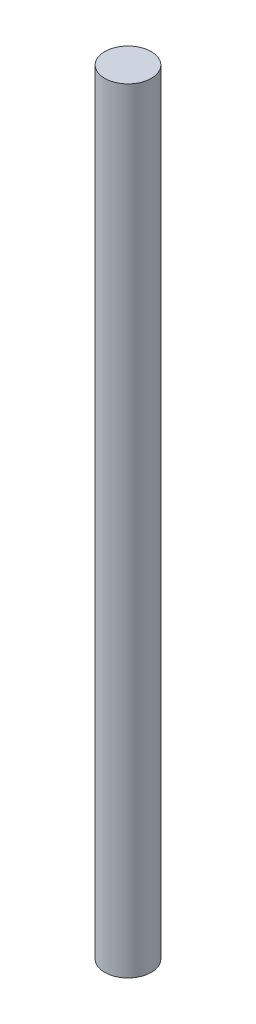
ISO-10303-21;
HEADER;
FILE_DESCRIPTION(('STEP AP214'),'2;1');
FILE_NAME('part.step','',(''),(''),'','','');
FILE_SCHEMA(('AUTOMOTIVE_DESIGN { 1 0 10303 214 1 1 1 1 }'));
ENDSEC;
DATA;
#1=APPLICATION_CONTEXT('core data for automotive mechanical design processes');
#2=APPLICATION_PROTOCOL_DEFINITION('international standard','automotive_design',2000,#1);
#3=PRODUCT_CONTEXT('',#1,'mechanical');
#4=PRODUCT('Part','Part','',(#3));
#5=PRODUCT_RELATED_PRODUCT_CATEGORY('part','',(#4));
#6=PRODUCT_DEFINITION_FORMATION('','',#4);
#7=PRODUCT_DEFINITION_CONTEXT('part definition',#1,'design');
#8=PRODUCT_DEFINITION('design','',#6,#7);
#9=PRODUCT_DEFINITION_SHAPE('','',#8);
#10=(LENGTH_UNIT() NAMED_UNIT(*) SI_UNIT(.MILLI.,.METRE.));
#11=(NAMED_UNIT(*) PLANE_ANGLE_UNIT() SI_UNIT($,.RADIAN.));
#12=(NAMED_UNIT(*) SI_UNIT($,.STERADIAN.) SOLID_ANGLE_UNIT());
#13=UNCERTAINTY_MEASURE_WITH_UNIT(LENGTH_MEASURE(1.E-05),#10,'distance_accuracy_value','');
#14=(GEOMETRIC_REPRESENTATION_CONTEXT(3) GLOBAL_UNCERTAINTY_ASSIGNED_CONTEXT((#13)) GLOBAL_UNIT_ASSIGNED_CONTEXT((#10,
#11,#12)) REPRESENTATION_CONTEXT('',''));
#15=CARTESIAN_POINT('',(0.,0.,0.));
#16=DIRECTION('',(0.,0.,1.));
#17=DIRECTION('',(1.,0.,0.));
#18=AXIS2_PLACEMENT_3D('',#15,#16,#17);
#19=CARTESIAN_POINT('',(0.,254.,0.));
#20=DIRECTION('',(0.,-1.,0.));
#21=DIRECTION('',(0.,0.,-1.));
#22=AXIS2_PLACEMENT_3D('',#19,#20,#21);
#23=CYLINDRICAL_SURFACE('',#22,7.62);
#24=CARTESIAN_POINT('',(-7.62,152.457141191728,0.));
#25=CARTESIAN_POINT('',(-7.61999996262098,152.457141228985,-0.127617746885966));
#26=CARTESIAN_POINT('',(-7.61678721155118,152.461956568334,-0.25523613761902));
#27=CARTESIAN_POINT('',(-7.60401717723376,152.48114196319,-0.50942964451652));
#28=CARTESIAN_POINT('',(-7.59445986059289,152.495512068987,-0.636004755186337));
#29=CARTESIAN_POINT('',(-7.56923436458532,152.533591244603,-0.88714246751425));
#30=CARTESIAN_POINT('',(-7.55356506543642,152.557302025743,-1.01170469603267));
#31=CARTESIAN_POINT('',(-7.51648114863573,152.613733774214,-1.25794442051148));
#32=CARTESIAN_POINT('',(-7.49506408901446,152.646458571358,-1.37962066637567));
#33=CARTESIAN_POINT('',(-7.4470922978135,152.720299024674,-1.61863932099152));
#34=CARTESIAN_POINT('',(-7.42056475238846,152.761370340811,-1.73600091320344));
#35=CARTESIAN_POINT('',(-7.36285704819492,152.851540042291,-1.96643610656319));
#36=CARTESIAN_POINT('',(-7.3316750772893,152.900641554797,-2.07950801598112));
#37=CARTESIAN_POINT('',(-7.23206912497054,153.059235575182,-2.41138843870645));
#38=CARTESIAN_POINT('',(-7.15754204702605,153.180082366248,-2.6230681218998));
#39=CARTESIAN_POINT('',(-6.99077032555177,153.459579117114,-3.04113633482946));
#40=CARTESIAN_POINT('',(-6.89755887015123,153.620566758732,-3.24555162647485));
#41=CARTESIAN_POINT('',(-6.70513705864374,153.970311537154,-3.62643959723586));
#42=CARTESIAN_POINT('',(-6.60591822981799,154.159108459656,-3.80287147775523));
#43=CARTESIAN_POINT('',(-6.45078342058081,154.476928623829,-4.05756073708782));
#44=CARTESIAN_POINT('',(-6.39420932724524,154.597686718325,-4.14589521221415));
#45=CARTESIAN_POINT('',(-6.28338545485444,154.847260938462,-4.31201177169172));
#46=CARTESIAN_POINT('',(-6.22913620548124,154.976078884151,-4.38979145994121));
#47=CARTESIAN_POINT('',(-6.07279003158617,155.373781915799,-4.60620528796506));
#48=CARTESIAN_POINT('',(-5.97676309388398,155.654558248684,-4.72843216660955));
#49=CARTESIAN_POINT('',(-5.84139107237761,156.157261566879,-4.89393723149807));
#50=CARTESIAN_POINT('',(-5.79368552552164,156.37277334643,-4.94982081665886));
#51=CARTESIAN_POINT('',(-5.7395455961546,156.702743375519,-5.01225835907994));
#52=CARTESIAN_POINT('',(-5.72440399142279,156.813815403436,-5.02950422340984));
#53=CARTESIAN_POINT('',(-5.70046405387001,157.037515689204,-5.05662437740369));
#54=CARTESIAN_POINT('',(-5.69166344313732,157.150143373375,-5.06650131429507));
#55=CARTESIAN_POINT('',(-5.68074948578405,157.376620887412,-5.07873521144173));
#56=CARTESIAN_POINT('',(-5.67866522134115,157.490473896108,-5.08105946850943));
#57=CARTESIAN_POINT('',(-5.68135266579794,157.717996369459,-5.07805435171623));
#58=CARTESIAN_POINT('',(-5.68612439798619,157.831665833489,-5.07272495185728));
#59=CARTESIAN_POINT('',(-5.70232662375294,158.057979460526,-5.05450484334684));
#60=CARTESIAN_POINT('',(-5.71376077695206,158.170623025448,-5.04160997901247));
#61=CARTESIAN_POINT('',(-5.74281859485651,158.39403210121,-5.00848400572688));
#62=CARTESIAN_POINT('',(-5.76044477130601,158.504796830773,-4.98824991957128));
#63=CARTESIAN_POINT('',(-5.81983166142429,158.823432309813,-4.91910322621232));
#64=CARTESIAN_POINT('',(-5.86896161360358,159.027985345247,-4.86084588795019));
#65=CARTESIAN_POINT('',(-5.98194460693858,159.424459020167,-4.72109659319144));
#66=CARTESIAN_POINT('',(-6.04580249151077,159.61637547725,-4.63959699117206));
#67=CARTESIAN_POINT('',(-6.19668831740874,160.023847217955,-4.43672136782301));
#68=CARTESIAN_POINT('',(-6.28578713164608,160.2362704391,-4.31060620938719));
#69=CARTESIAN_POINT('',(-6.46917480947397,160.639481948972,-4.03016988728501));
#70=CARTESIAN_POINT('',(-6.56346997295596,160.830243078282,-3.87581393519043));
#71=CARTESIAN_POINT('',(-6.71351630333428,161.117903710656,-3.60648613944879));
#72=CARTESIAN_POINT('',(-6.76990109347029,161.222306116758,-3.49976202684487));
#73=CARTESIAN_POINT('',(-6.88052527356067,161.421793965663,-3.27692300416797));
#74=CARTESIAN_POINT('',(-6.93476529372603,161.516882157634,-3.1608108836265));
#75=CARTESIAN_POINT('',(-7.03969828006079,161.697033644724,-2.91964698038765));
#76=CARTESIAN_POINT('',(-7.09039295003375,161.782101768867,-2.79459955100152));
#77=CARTESIAN_POINT('',(-7.18692277233618,161.941443255764,-2.5360529205925));
#78=CARTESIAN_POINT('',(-7.23275939750129,162.015719892769,-2.40255630086597));
#79=CARTESIAN_POINT('',(-7.30990929299163,162.139164029429,-2.15476509466536));
#80=CARTESIAN_POINT('',(-7.34230835518797,162.190399594928,-2.04183460287157));
#81=CARTESIAN_POINT('',(-7.40250656665309,162.284817161172,-1.81147993449472));
#82=CARTESIAN_POINT('',(-7.43030664719178,162.328000792616,-1.69405667361825));
#83=CARTESIAN_POINT('',(-7.48071872152643,162.405819754923,-1.45537541198262));
#84=CARTESIAN_POINT('',(-7.50333290026611,162.440458686338,-1.33411905079239));
#85=CARTESIAN_POINT('',(-7.54287505182436,162.50075704731,-1.08852955502291));
#86=CARTESIAN_POINT('',(-7.5598053108681,162.526420087386,-0.964197679156246));
#87=CARTESIAN_POINT('',(-7.58765509891183,162.568518805272,-0.712717181424218));
#88=CARTESIAN_POINT('',(-7.59854671895369,162.584911645573,-0.585558260183759));
#89=CARTESIAN_POINT('',(-7.61392829743813,162.608036466345,-0.329976488290464));
#90=CARTESIAN_POINT('',(-7.61841824751586,162.614768434193,-0.201553635986313));
#91=CARTESIAN_POINT('',(-7.62088178440928,162.618463967,0.0554901658999742));
#92=CARTESIAN_POINT('',(-7.61885563980564,162.615427934577,0.184111107098858));
#93=CARTESIAN_POINT('',(-7.60833989578579,162.599637647387,0.440481656838009));
#94=CARTESIAN_POINT('',(-7.59985057223172,162.586883807397,0.568231302332222));
#95=CARTESIAN_POINT('',(-7.57744159693153,162.553092711807,0.812885438213823));
#96=CARTESIAN_POINT('',(-7.56394742055392,162.532703500947,0.929919084535278));
#97=CARTESIAN_POINT('',(-7.53184907032541,162.483966507718,1.16161822660272));
#98=CARTESIAN_POINT('',(-7.51324316585562,162.455616029924,1.27628290615337));
#99=CARTESIAN_POINT('',(-7.45029954591581,162.3591104138,1.61561088945221));
#100=CARTESIAN_POINT('',(-7.39881665459267,162.27947273482,1.83580865905511));
#101=CARTESIAN_POINT('',(-7.27700416125648,162.087157855439,2.27248489517402));
#102=CARTESIAN_POINT('',(-7.20572184152947,161.97277152904,2.48793012032103));
#103=CARTESIAN_POINT('',(-7.05108799298423,161.716882387669,2.89732506341926));
#104=CARTESIAN_POINT('',(-6.96772901819371,161.575362825916,3.0912613886612));
#105=CARTESIAN_POINT('',(-6.78064520017368,161.243996625296,3.48451356701568));
#106=CARTESIAN_POINT('',(-6.67578430744782,161.050046732487,3.67983063193266));
#107=CARTESIAN_POINT('',(-6.46610787171141,160.633118318396,4.03692192070114));
#108=CARTESIAN_POINT('',(-6.3612924096138,160.410119905538,4.19867296088972));
#109=CARTESIAN_POINT('',(-6.1706678310225,159.957399414649,4.47356952391553));
#110=CARTESIAN_POINT('',(-6.08400097076412,159.72984177341,4.58966919448945));
#111=CARTESIAN_POINT('',(-5.92934994006038,159.254504707748,4.78780379216236));
#112=CARTESIAN_POINT('',(-5.8613322183041,159.006762652678,4.86990003194031));
#113=CARTESIAN_POINT('',(-5.76410352060607,158.541547259549,4.98439038169018));
#114=CARTESIAN_POINT('',(-5.73011306478407,158.32664434009,5.02306819931157));
#115=CARTESIAN_POINT('',(-5.6865383326163,157.891285511238,5.07236000912963));
#116=CARTESIAN_POINT('',(-5.6769275475045,157.670835896671,5.08300448332479));
#117=CARTESIAN_POINT('',(-5.6836111361922,157.230706145817,5.07552694584853));
#118=CARTESIAN_POINT('',(-5.69992084903063,157.011026542315,5.0573879008906));
#119=CARTESIAN_POINT('',(-5.75590389554002,156.578694912358,4.99356624467359));
#120=CARTESIAN_POINT('',(-5.7956083974295,156.366052661475,4.94784688700228));
#121=CARTESIAN_POINT('',(-5.9061893809842,155.897005063228,4.8156512096842));
#122=CARTESIAN_POINT('',(-5.98255291828197,155.644036583356,4.72156086351185));
#123=CARTESIAN_POINT('',(-6.10994787316129,155.281852684572,4.55388627620342));
#124=CARTESIAN_POINT('',(-6.15460906179107,155.163886114801,4.49349282724096));
#125=CARTESIAN_POINT('',(-6.24691093495906,154.93388160206,4.36426658316709));
#126=CARTESIAN_POINT('',(-6.29455167497643,154.821843769555,4.29543363088945));
#127=CARTESIAN_POINT('',(-6.44182845438738,154.491039513831,4.07417271638668));
#128=CARTESIAN_POINT('',(-6.54425147265685,154.281811163003,3.90895217742539));
#129=CARTESIAN_POINT('',(-6.69628275719978,153.98902918156,3.63799494029075));
#130=CARTESIAN_POINT('',(-6.74671474780653,153.894908058631,3.54377433504861));
#131=CARTESIAN_POINT('',(-6.84609726230248,153.71395147358,3.34774666169822));
#132=CARTESIAN_POINT('',(-6.8950474464962,153.62711767407,3.24593787228731));
#133=CARTESIAN_POINT('',(-6.99732012087378,153.449291751601,3.01984239700191));
#134=CARTESIAN_POINT('',(-7.05025638742987,153.359503140711,2.89443056774434));
#135=CARTESIAN_POINT('',(-7.15139438985639,153.19099576345,2.63464848843462));
#136=CARTESIAN_POINT('',(-7.19959826543615,153.112271987194,2.50028233356841));
#137=CARTESIAN_POINT('',(-7.28986792794205,152.966865562902,2.22337826509095));
#138=CARTESIAN_POINT('',(-7.33193942755464,152.90017169433,2.08084813142758));
#139=CARTESIAN_POINT('',(-7.40867390005312,152.779767642797,1.78850824176947));
#140=CARTESIAN_POINT('',(-7.44333947411519,152.726052900319,1.63870106444927));
#141=CARTESIAN_POINT('',(-7.49734490177222,152.642967258261,1.3670831518724));
#142=CARTESIAN_POINT('',(-7.51837859879747,152.610839244575,1.24644491044703));
#143=CARTESIAN_POINT('',(-7.55479724252701,152.555434764711,1.00232587841927));
#144=CARTESIAN_POINT('',(-7.57018335017864,152.532156479301,0.878845677577027));
#145=CARTESIAN_POINT('',(-7.59494261773714,152.494785678047,0.629979822141985));
#146=CARTESIAN_POINT('',(-7.60431935148882,152.480687702484,0.504595345552925));
#147=CARTESIAN_POINT('',(-7.61684817787359,152.461865265076,0.252807481889055));
#148=CARTESIAN_POINT('',(-7.62000003702353,152.457141154825,0.126404056773974));
#149=CARTESIAN_POINT('',(-7.62,152.457141191728,0.));
#150=B_SPLINE_CURVE_WITH_KNOTS('',3,(#24,#25,#26,#27,#28,#29,#30,#31,#32,#33,#34,#35,#36,#37,
#38,#39,#40,#41,#42,#43,#44,#45,#46,#47,#48,#49,#50,#51,#52,#53,#54,#55,#56,#57,#58,#59,#60,#61,
#62,#63,#64,#65,#66,#67,#68,#69,#70,#71,#72,#73,#74,#75,#76,#77,#78,#79,#80,#81,#82,#83,#84,#85,
#86,#87,#88,#89,#90,#91,#92,#93,#94,#95,#96,#97,#98,#99,#100,#101,#102,#103,#104,#105,#106,#107,
#108,#109,#110,#111,#112,#113,#114,#115,#116,#117,#118,#119,#120,#121,#122,#123,#124,#125,#126,
#127,#128,#129,#130,#131,#132,#133,#134,#135,#136,#137,#138,#139,#140,#141,#142,#143,#144,#145,
#146,#147,#148,#149),.UNSPECIFIED.,.T.,.F.,(4,2,2,2,2,2,2,2,2,2,2,2,2,2,2,2,2,2,2,2,2,2,2,2,2,2,
2,2,2,2,2,2,2,2,2,2,2,2,2,2,2,2,2,2,2,2,2,2,2,2,2,2,2,2,2,2,2,2,2,2,2,2,4),(0.,
0.382724304494356,0.765450623391245,1.1482470949055,1.53120645789785,1.91218220980246,
2.29330667818772,3.05490100331616,3.88112198568064,4.70853670380648,5.18788266614489,
5.66733726611884,6.62361226871504,7.30378332977206,7.64366074377091,7.9834160006955,
8.32464045494009,8.66586606826361,9.00727929132687,9.34883116612378,10.001064175557,
10.6535119844494,11.4386714721866,12.2248047518138,12.7030884685134,13.1812305876992,
13.6591413222927,14.136906749528,14.5210404356781,14.9050962412864,15.2889899365382,
15.6727290339158,16.0582271922565,16.4437258543145,16.8292086270759,17.2146749475402,
17.5729401183997,17.9313267327591,18.6474967595424,19.4070479885001,20.1670695346385,
21.0472740530192,21.9280845096946,22.734386735764,23.5392286957047,24.1993091986401,
24.8586716674908,25.5184244742578,26.1790582448812,27.0157262401168,27.4349567772388,
27.854195122746,28.7072930311398,29.1342224323657,29.5612489746811,30.0498026563746,
30.538134415497,31.0260083155485,31.5137105773705,31.8930846312381,32.2723806553028,
32.6514508977584,33.0305353581455),.UNSPECIFIED.);
#151=CARTESIAN_POINT('',(-7.62,152.457141191728,0.));
#152=VERTEX_POINT('',#151);
#153=EDGE_CURVE('E10',#152,#152,#150,.T.);
#154=ORIENTED_EDGE('',*,*,#153,.T.);
#155=EDGE_LOOP('',(#154));
#156=FACE_BOUND('',#155,.T.);
#157=CARTESIAN_POINT('',(-7.62,76.2571411917279,0.));
#158=CARTESIAN_POINT('',(-7.61999996262098,76.257141228985,-0.127617746885965));
#159=CARTESIAN_POINT('',(-7.61678721155118,76.2619565683338,-0.255236137619019));
#160=CARTESIAN_POINT('',(-7.60401717723376,76.2811419631901,-0.509429644516521));
#161=CARTESIAN_POINT('',(-7.59445986059289,76.295512068987,-0.636004755186339));
#162=CARTESIAN_POINT('',(-7.56923436458532,76.3335912446026,-0.88714246751425));
#163=CARTESIAN_POINT('',(-7.55356506543642,76.3573020257433,-1.01170469603267));
#164=CARTESIAN_POINT('',(-7.51648114863573,76.4137337742141,-1.25794442051148));
#165=CARTESIAN_POINT('',(-7.49506408901446,76.4464585713576,-1.37962066637568));
#166=CARTESIAN_POINT('',(-7.44709229781349,76.5202990246736,-1.61863932099152));
#167=CARTESIAN_POINT('',(-7.42056475238846,76.5613703408108,-1.73600091320344));
#168=CARTESIAN_POINT('',(-7.36285704819492,76.6515400422913,-1.96643610656319));
#169=CARTESIAN_POINT('',(-7.3316750772893,76.7006415547973,-2.07950801598113));
#170=CARTESIAN_POINT('',(-7.23206912497054,76.859235575182,-2.41138843870646));
#171=CARTESIAN_POINT('',(-7.15754204702605,76.9800823662479,-2.6230681218998));
#172=CARTESIAN_POINT('',(-6.99077032555177,77.2595791171136,-3.04113633482946));
#173=CARTESIAN_POINT('',(-6.89755887015124,77.4205667587322,-3.24555162647484));
#174=CARTESIAN_POINT('',(-6.70513705864375,77.7703115371535,-3.62643959723586));
#175=CARTESIAN_POINT('',(-6.60591822981799,77.959108459656,-3.80287147775524));
#176=CARTESIAN_POINT('',(-6.4507834205808,78.2769286238295,-4.05756073708783));
#177=CARTESIAN_POINT('',(-6.39420932724524,78.397686718325,-4.14589521221416));
#178=CARTESIAN_POINT('',(-6.28338545485444,78.6472609384624,-4.31201177169172));
#179=CARTESIAN_POINT('',(-6.22913620548123,78.7760788841515,-4.38979145994122));
#180=CARTESIAN_POINT('',(-6.07279003158616,79.1737819157988,-4.60620528796507));
#181=CARTESIAN_POINT('',(-5.97676309388397,79.4545582486842,-4.72843216660955));
#182=CARTESIAN_POINT('',(-5.84139107237761,79.9572615668791,-4.89393723149807));
#183=CARTESIAN_POINT('',(-5.79368552552164,80.1727733464305,-4.94982081665885));
#184=CARTESIAN_POINT('',(-5.7395455961546,80.5027433755189,-5.01225835907994));
#185=CARTESIAN_POINT('',(-5.72440399142279,80.6138154034357,-5.02950422340984));
#186=CARTESIAN_POINT('',(-5.70046405387,80.8375156892042,-5.0566243774037));
#187=CARTESIAN_POINT('',(-5.69166344313732,80.9501433733752,-5.06650131429508));
#188=CARTESIAN_POINT('',(-5.68074948578404,81.1766208874115,-5.07873521144174));
#189=CARTESIAN_POINT('',(-5.67866522134114,81.2904738961076,-5.08105946850944));
#190=CARTESIAN_POINT('',(-5.68135266579793,81.5179963694586,-5.07805435171625));
#191=CARTESIAN_POINT('',(-5.68612439798618,81.6316658334887,-5.07272495185729));
#192=CARTESIAN_POINT('',(-5.70232662375293,81.8579794605254,-5.05450484334686));
#193=CARTESIAN_POINT('',(-5.71376077695204,81.9706230254483,-5.04160997901249));
#194=CARTESIAN_POINT('',(-5.74281859485649,82.1940321012103,-5.00848400572691));
#195=CARTESIAN_POINT('',(-5.76044477130598,82.3047968307728,-4.98824991957131));
#196=CARTESIAN_POINT('',(-5.81983166142426,82.6234323098133,-4.91910322621235));
#197=CARTESIAN_POINT('',(-5.86896161360355,82.8279853452473,-4.86084588795023));
#198=CARTESIAN_POINT('',(-5.98194460693855,83.2244590201673,-4.72109659319149));
#199=CARTESIAN_POINT('',(-6.04580249151073,83.4163754772494,-4.63959699117211));
#200=CARTESIAN_POINT('',(-6.19668831740869,83.8238472179546,-4.43672136782308));
#201=CARTESIAN_POINT('',(-6.28578713164603,84.0362704390995,-4.31060620938726));
#202=CARTESIAN_POINT('',(-6.46917480947392,84.4394819489717,-4.0301698872851));
#203=CARTESIAN_POINT('',(-6.56346997295591,84.6302430782815,-3.87581393519052));
#204=CARTESIAN_POINT('',(-6.71351630333423,84.9179037106559,-3.60648613944889));
#205=CARTESIAN_POINT('',(-6.76990109347024,85.0223061167582,-3.49976202684497));
#206=CARTESIAN_POINT('',(-6.88052527356062,85.2217939656632,-3.27692300416808));
#207=CARTESIAN_POINT('',(-6.93476529372598,85.3168821576338,-3.16081088362661));
#208=CARTESIAN_POINT('',(-7.03969828006075,85.4970336447238,-2.91964698038777));
#209=CARTESIAN_POINT('',(-7.09039295003371,85.5821017688665,-2.79459955100163));
#210=CARTESIAN_POINT('',(-7.18692277233614,85.7414432557636,-2.53605292059262));
#211=CARTESIAN_POINT('',(-7.23275939750125,85.8157198927694,-2.4025563008661));
#212=CARTESIAN_POINT('',(-7.3099092929916,85.9391640294287,-2.15476509466549));
#213=CARTESIAN_POINT('',(-7.34230835518793,85.9903995949283,-2.0418346028717));
#214=CARTESIAN_POINT('',(-7.40250656665306,86.0848171611716,-1.81147993449485));
#215=CARTESIAN_POINT('',(-7.43030664719175,86.1280007926157,-1.69405667361839));
#216=CARTESIAN_POINT('',(-7.4807187215264,86.2058197549226,-1.45537541198276));
#217=CARTESIAN_POINT('',(-7.50333290026608,86.240458686338,-1.33411905079252));
#218=CARTESIAN_POINT('',(-7.54287505182434,86.3007570473101,-1.08852955502304));
#219=CARTESIAN_POINT('',(-7.55980531086809,86.3264200873855,-0.964197679156373));
#220=CARTESIAN_POINT('',(-7.58765509891182,86.3685188052721,-0.712717181424341));
#221=CARTESIAN_POINT('',(-7.59854671895368,86.3849116455726,-0.585558260183882));
#222=CARTESIAN_POINT('',(-7.61392829743812,86.4080364663446,-0.329976488290586));
#223=CARTESIAN_POINT('',(-7.61841824751585,86.4147684341926,-0.201553635986435));
#224=CARTESIAN_POINT('',(-7.62088178440928,86.4184639669999,0.0554901658998521));
#225=CARTESIAN_POINT('',(-7.61885563980564,86.4154279345771,0.184111107098735));
#226=CARTESIAN_POINT('',(-7.6083398957858,86.3996376473874,0.440481656837888));
#227=CARTESIAN_POINT('',(-7.59985057223173,86.3868838073971,0.568231302332103));
#228=CARTESIAN_POINT('',(-7.57744159693154,86.3530927118072,0.812885438213705));
#229=CARTESIAN_POINT('',(-7.56394742055393,86.3327035009466,0.929919084535159));
#230=CARTESIAN_POINT('',(-7.53184907032542,86.2839665077182,1.1616182266026));
#231=CARTESIAN_POINT('',(-7.51324316585564,86.255616029924,1.27628290615325));
#232=CARTESIAN_POINT('',(-7.45029954591584,86.1591104138001,1.6156108894521));
#233=CARTESIAN_POINT('',(-7.39881665459269,86.0794727348201,1.835808659055));
#234=CARTESIAN_POINT('',(-7.27700416125651,85.8871578554388,2.27248489517392));
#235=CARTESIAN_POINT('',(-7.20572184152951,85.7727715290398,2.48793012032092));
#236=CARTESIAN_POINT('',(-7.05108799298427,85.516882387669,2.89732506341916));
#237=CARTESIAN_POINT('',(-6.96772901819376,85.3753628259156,3.0912613886611));
#238=CARTESIAN_POINT('',(-6.78064520017372,85.0439966252962,3.48451356701559));
#239=CARTESIAN_POINT('',(-6.67578430744787,84.8500467324873,3.67983063193257));
#240=CARTESIAN_POINT('',(-6.46610787171146,84.433118318396,4.03692192070106));
#241=CARTESIAN_POINT('',(-6.36129240961385,84.2101199055378,4.19867296088965));
#242=CARTESIAN_POINT('',(-6.17066783102255,83.7573994146494,4.47356952391547));
#243=CARTESIAN_POINT('',(-6.08400097076416,83.5298417734102,4.58966919448941));
#244=CARTESIAN_POINT('',(-5.9293499400604,83.0545047077482,4.78780379216234));
#245=CARTESIAN_POINT('',(-5.86133221830411,82.8067626526785,4.86990003194029));
#246=CARTESIAN_POINT('',(-5.76410352060608,82.3415472595487,4.98439038169017));
#247=CARTESIAN_POINT('',(-5.73011306478407,82.1266443400897,5.02306819931157));
#248=CARTESIAN_POINT('',(-5.6865383326163,81.6912855112379,5.07236000912964));
#249=CARTESIAN_POINT('',(-5.67692754750449,81.4708358966707,5.0830044833248));
#250=CARTESIAN_POINT('',(-5.68361113619218,81.0307061458175,5.07552694584855));
#251=CARTESIAN_POINT('',(-5.69992084903061,80.8110265423151,5.05738790089063));
#252=CARTESIAN_POINT('',(-5.75590389554,80.3786949123583,4.99356624467362));
#253=CARTESIAN_POINT('',(-5.79560839742947,80.1660526614751,4.94784688700231));
#254=CARTESIAN_POINT('',(-5.90618938098417,79.6970050632284,4.81565120968424));
#255=CARTESIAN_POINT('',(-5.98255291828193,79.444036583356,4.72156086351189));
#256=CARTESIAN_POINT('',(-6.10994787316124,79.0818526845719,4.55388627620348));
#257=CARTESIAN_POINT('',(-6.15460906179103,78.9638861148012,4.49349282724102));
#258=CARTESIAN_POINT('',(-6.24691093495901,78.7338816020605,4.36426658316715));
#259=CARTESIAN_POINT('',(-6.29455167497638,78.6218437695551,4.29543363088952));
#260=CARTESIAN_POINT('',(-6.44182845438734,78.2910395138314,4.07417271638675));
#261=CARTESIAN_POINT('',(-6.54425147265679,78.081811163003,3.90895217742548));
#262=CARTESIAN_POINT('',(-6.69628275719973,77.7890291815605,3.63799494029084));
#263=CARTESIAN_POINT('',(-6.74671474780648,77.694908058631,3.5437743350487));
#264=CARTESIAN_POINT('',(-6.84609726230243,77.5139514735805,3.34774666169833));
#265=CARTESIAN_POINT('',(-6.89504744649615,77.4271176740703,3.24593787228743));
#266=CARTESIAN_POINT('',(-6.99732012087373,77.2492917516006,3.01984239700204));
#267=CARTESIAN_POINT('',(-7.05025638742982,77.1595031407114,2.89443056774447));
#268=CARTESIAN_POINT('',(-7.15139438985634,76.9909957634499,2.63464848843475));
#269=CARTESIAN_POINT('',(-7.1995982654361,76.9122719871941,2.50028233356854));
#270=CARTESIAN_POINT('',(-7.28986792794201,76.7668655629025,2.22337826509108));
#271=CARTESIAN_POINT('',(-7.3319394275546,76.7001716943297,2.0808481314277));
#272=CARTESIAN_POINT('',(-7.40867390005309,76.5797676427967,1.78850824176959));
#273=CARTESIAN_POINT('',(-7.44333947411517,76.526052900319,1.63870106444939));
#274=CARTESIAN_POINT('',(-7.4973449017722,76.442967258261,1.36708315187251));
#275=CARTESIAN_POINT('',(-7.51837859879745,76.4108392445753,1.24644491044713));
#276=CARTESIAN_POINT('',(-7.554797242527,76.3554347647108,1.00232587841935));
#277=CARTESIAN_POINT('',(-7.57018335017863,76.3321564793014,0.878845677577102));
#278=CARTESIAN_POINT('',(-7.59494261773714,76.2947856780471,0.62997982214204));
#279=CARTESIAN_POINT('',(-7.60431935148881,76.2806877024845,0.504595345552969));
#280=CARTESIAN_POINT('',(-7.61684817787359,76.2618652650756,0.252807481889078));
#281=CARTESIAN_POINT('',(-7.62000003702353,76.2571411548251,0.126404056773986));
#282=CARTESIAN_POINT('',(-7.62,76.2571411917279,0.));
#283=B_SPLINE_CURVE_WITH_KNOTS('',3,(#157,#158,#159,#160,#161,#162,#163,#164,#165,#166,#167,
#168,#169,#170,#171,#172,#173,#174,#175,#176,#177,#178,#179,#180,#181,#182,#183,#184,#185,#186,
#187,#188,#189,#190,#191,#192,#193,#194,#195,#196,#197,#198,#199,#200,#201,#202,#203,#204,#205,
#206,#207,#208,#209,#210,#211,#212,#213,#214,#215,#216,#217,#218,#219,#220,#221,#222,#223,#224,
#225,#226,#227,#228,#229,#230,#231,#232,#233,#234,#235,#236,#237,#238,#239,#240,#241,#242,#243,
#244,#245,#246,#247,#248,#249,#250,#251,#252,#253,#254,#255,#256,#257,#258,#259,#260,#261,#262,
#263,#264,#265,#266,#267,#268,#269,#270,#271,#272,#273,#274,#275,#276,#277,#278,#279,#280,#281,
#282),.UNSPECIFIED.,.T.,.F.,(4,2,2,2,2,2,2,2,2,2,2,2,2,2,2,2,2,2,2,2,2,2,2,2,2,2,2,2,2,2,2,2,2,
2,2,2,2,2,2,2,2,2,2,2,2,2,2,2,2,2,2,2,2,2,2,2,2,2,2,2,2,2,4),(0.,0.382724304494355,
0.765450623391246,1.1482470949055,1.53120645789785,1.91218220980246,2.29330667818772,
3.05490100331616,3.88112198568063,4.7085367038065,5.18788266614489,5.66733726611884,
6.62361226871503,7.30378332977202,7.64366074377086,7.98341600069545,8.32464045494004,
8.66586606826353,9.00727929132682,9.34883116612372,10.001064175557,10.6535119844493,
11.4386714721865,12.2248047518137,12.7030884685132,13.1812305876991,13.6591413222926,
14.1369067495279,14.521040435678,14.9050962412863,15.288989936538,15.6727290339157,
16.0582271922565,16.4437258543144,16.8292086270758,17.2146749475402,17.5729401183996,
17.9313267327591,18.6474967595423,19.4070479885,20.1670695346384,21.0472740530191,
21.9280845096945,22.734386735764,23.5392286957046,24.1993091986401,24.8586716674908,
25.5184244742578,26.1790582448812,27.0157262401168,27.4349567772387,27.8541951227459,
28.7072930311398,29.1342224323656,29.561248974681,30.0498026563745,30.5381344154969,
31.0260083155485,31.5137105773704,31.8930846312381,32.2723806553028,32.6514508977584,
33.0305353581456),.UNSPECIFIED.);
#284=CARTESIAN_POINT('',(-7.62,76.2571411917279,0.));
#285=VERTEX_POINT('',#284);
#286=EDGE_CURVE('E42',#285,#285,#283,.T.);
#287=ORIENTED_EDGE('',*,*,#286,.T.);
#288=EDGE_LOOP('',(#287));
#289=FACE_BOUND('',#288,.T.);
#290=CARTESIAN_POINT('',(0.,254.,0.));
#291=DIRECTION('',(0.,1.,0.));
#292=DIRECTION('',(0.,0.,1.));
#293=AXIS2_PLACEMENT_3D('',#290,#291,#292);
#294=CIRCLE('',#293,7.62);
#295=CARTESIAN_POINT('',(0.,254.,7.62));
#296=VERTEX_POINT('',#295);
#297=EDGE_CURVE('E46',#296,#296,#294,.T.);
#298=ORIENTED_EDGE('',*,*,#297,.F.);
#299=EDGE_LOOP('',(#298));
#300=FACE_BOUND('',#299,.T.);
#301=CARTESIAN_POINT('',(0.,0.,0.));
#302=DIRECTION('',(0.,1.,0.));
#303=DIRECTION('',(0.,0.,1.));
#304=AXIS2_PLACEMENT_3D('',#301,#302,#303);
#305=CIRCLE('',#304,7.62);
#306=CARTESIAN_POINT('',(0.,0.,7.62));
#307=VERTEX_POINT('',#306);
#308=EDGE_CURVE('E50',#307,#307,#305,.T.);
#309=ORIENTED_EDGE('',*,*,#308,.T.);
#310=EDGE_LOOP('',(#309));
#311=FACE_BOUND('',#310,.T.);
#312=ADVANCED_FACE('F31',(#156,#289,#300,#311),#23,.T.);
#313=CARTESIAN_POINT('',(0.,254.,0.));
#314=DIRECTION('',(0.,1.,0.));
#315=DIRECTION('',(0.,0.,1.));
#316=AXIS2_PLACEMENT_3D('',#313,#314,#315);
#317=PLANE('',#316);
#318=ORIENTED_EDGE('',*,*,#297,.T.);
#319=EDGE_LOOP('',(#318));
#320=FACE_BOUND('',#319,.T.);
#321=ADVANCED_FACE('F65',(#320),#317,.T.);
#322=CARTESIAN_POINT('',(0.,0.,0.));
#323=DIRECTION('',(0.,1.,0.));
#324=DIRECTION('',(0.,0.,1.));
#325=AXIS2_PLACEMENT_3D('',#322,#323,#324);
#326=PLANE('',#325);
#327=ORIENTED_EDGE('',*,*,#308,.F.);
#328=EDGE_LOOP('',(#327));
#329=FACE_BOUND('',#328,.T.);
#330=ADVANCED_FACE('F63',(#329),#326,.F.);
#331=CARTESIAN_POINT('',(-7.62,81.3371411917279,0.));
#332=DIRECTION('',(1.,0.,0.));
#333=DIRECTION('',(0.,0.,-1.));
#334=AXIS2_PLACEMENT_3D('',#331,#332,#333);
#335=CYLINDRICAL_SURFACE('',#334,5.08);
#336=CARTESIAN_POINT('',(0.,81.3371411917279,0.));
#337=DIRECTION('',(1.,0.,0.));
#338=DIRECTION('',(0.,0.,-1.));
#339=AXIS2_PLACEMENT_3D('',#336,#337,#338);
#340=CIRCLE('',#339,5.08);
#341=CARTESIAN_POINT('',(0.,81.3371411917279,-5.08));
#342=VERTEX_POINT('',#341);
#343=EDGE_CURVE('E82',#342,#342,#340,.T.);
#344=ORIENTED_EDGE('',*,*,#343,.T.);
#345=EDGE_LOOP('',(#344));
#346=FACE_BOUND('',#345,.T.);
#347=ORIENTED_EDGE('',*,*,#286,.F.);
#348=EDGE_LOOP('',(#347));
#349=FACE_BOUND('',#348,.T.);
#350=ADVANCED_FACE('F57',(#346,#349),#335,.F.);
#351=CARTESIAN_POINT('',(0.,81.3371411917279,0.));
#352=DIRECTION('',(1.,0.,0.));
#353=DIRECTION('',(0.,0.,-1.));
#354=AXIS2_PLACEMENT_3D('',#351,#352,#353);
#355=PLANE('',#354);
#356=ORIENTED_EDGE('',*,*,#343,.F.);
#357=EDGE_LOOP('',(#356));
#358=FACE_BOUND('',#357,.T.);
#359=ADVANCED_FACE('F62',(#358),#355,.F.);
#360=CARTESIAN_POINT('',(-7.62,157.537141191728,0.));
#361=DIRECTION('',(1.,0.,0.));
#362=DIRECTION('',(0.,0.,-1.));
#363=AXIS2_PLACEMENT_3D('',#360,#361,#362);
#364=CYLINDRICAL_SURFACE('',#363,5.07999999999999);
#365=CARTESIAN_POINT('',(0.,157.537141191728,0.));
#366=DIRECTION('',(1.,0.,0.));
#367=DIRECTION('',(0.,0.,-1.));
#368=AXIS2_PLACEMENT_3D('',#365,#366,#367);
#369=CIRCLE('',#368,5.07999999999999);
#370=CARTESIAN_POINT('',(0.,157.537141191728,-5.07999999999999));
#371=VERTEX_POINT('',#370);
#372=EDGE_CURVE('E80',#371,#371,#369,.T.);
#373=ORIENTED_EDGE('',*,*,#372,.T.);
#374=EDGE_LOOP('',(#373));
#375=FACE_BOUND('',#374,.T.);
#376=ORIENTED_EDGE('',*,*,#153,.F.);
#377=EDGE_LOOP('',(#376));
#378=FACE_BOUND('',#377,.T.);
#379=ADVANCED_FACE('F92',(#375,#378),#364,.F.);
#380=CARTESIAN_POINT('',(0.,157.537141191728,0.));
#381=DIRECTION('',(1.,0.,0.));
#382=DIRECTION('',(0.,0.,-1.));
#383=AXIS2_PLACEMENT_3D('',#380,#381,#382);
#384=PLANE('',#383);
#385=ORIENTED_EDGE('',*,*,#372,.F.);
#386=EDGE_LOOP('',(#385));
#387=FACE_BOUND('',#386,.T.);
#388=ADVANCED_FACE('F96',(#387),#384,.F.);
#389=CLOSED_SHELL('',(#312,#321,#330,#350,#359,#379,#388));
#390=MANIFOLD_SOLID_BREP('B2',#389);
#391=ADVANCED_BREP_SHAPE_REPRESENTATION('',(#18,#390),#14);
#392=SHAPE_DEFINITION_REPRESENTATION(#9,#391);
ENDSEC;
END-ISO-10303-21;
